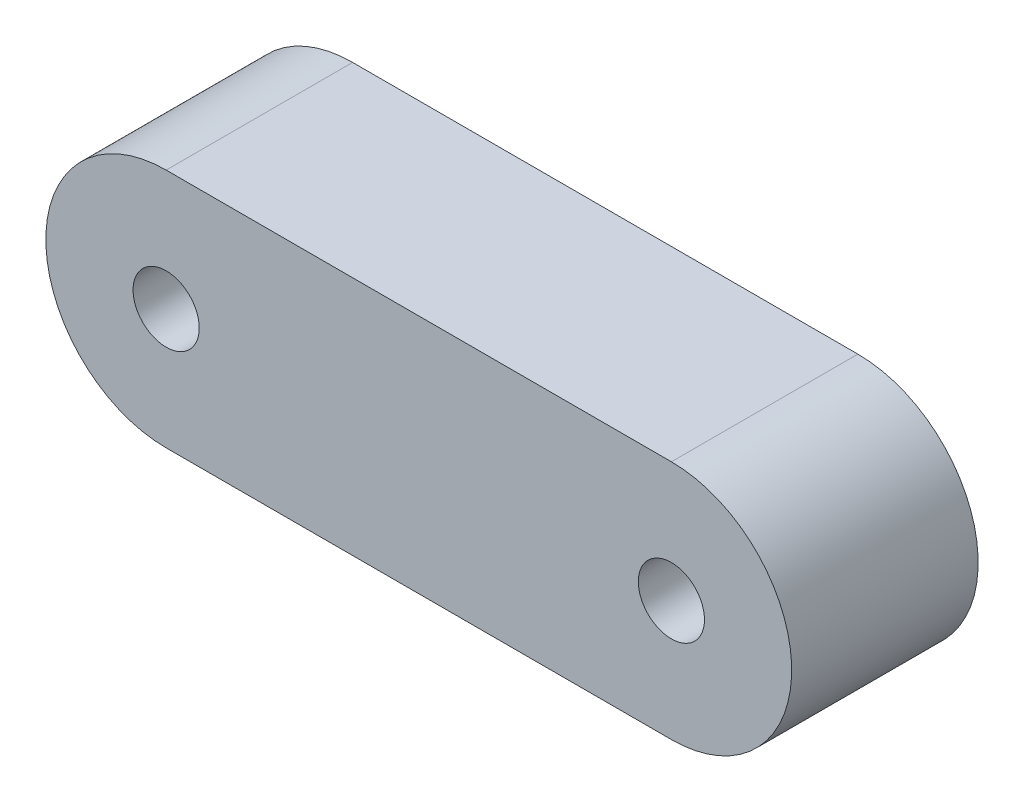
ISO-10303-21;
HEADER;
FILE_DESCRIPTION(('STEP AP214'),'2;1');
FILE_NAME('part.step','',(''),(''),'','','');
FILE_SCHEMA(('AUTOMOTIVE_DESIGN { 1 0 10303 214 1 1 1 1 }'));
ENDSEC;
DATA;
#1=APPLICATION_CONTEXT('core data for automotive mechanical design processes');
#2=APPLICATION_PROTOCOL_DEFINITION('international standard','automotive_design',2000,#1);
#3=PRODUCT_CONTEXT('',#1,'mechanical');
#4=PRODUCT('Part','Part','',(#3));
#5=PRODUCT_RELATED_PRODUCT_CATEGORY('part','',(#4));
#6=PRODUCT_DEFINITION_FORMATION('','',#4);
#7=PRODUCT_DEFINITION_CONTEXT('part definition',#1,'design');
#8=PRODUCT_DEFINITION('design','',#6,#7);
#9=PRODUCT_DEFINITION_SHAPE('','',#8);
#10=(LENGTH_UNIT() NAMED_UNIT(*) SI_UNIT(.MILLI.,.METRE.));
#11=(NAMED_UNIT(*) PLANE_ANGLE_UNIT() SI_UNIT($,.RADIAN.));
#12=(NAMED_UNIT(*) SI_UNIT($,.STERADIAN.) SOLID_ANGLE_UNIT());
#13=UNCERTAINTY_MEASURE_WITH_UNIT(LENGTH_MEASURE(1.E-05),#10,'distance_accuracy_value','');
#14=(GEOMETRIC_REPRESENTATION_CONTEXT(3) GLOBAL_UNCERTAINTY_ASSIGNED_CONTEXT((#13)) GLOBAL_UNIT_ASSIGNED_CONTEXT((#10,
#11,#12)) REPRESENTATION_CONTEXT('',''));
#15=CARTESIAN_POINT('',(0.,0.,0.));
#16=DIRECTION('',(0.,0.,1.));
#17=DIRECTION('',(1.,0.,0.));
#18=AXIS2_PLACEMENT_3D('',#15,#16,#17);
#19=CARTESIAN_POINT('',(0.,0.,15.5));
#20=DIRECTION('',(0.,0.,1.));
#21=DIRECTION('',(1.,0.,0.));
#22=AXIS2_PLACEMENT_3D('',#19,#20,#21);
#23=PLANE('',#22);
#24=CARTESIAN_POINT('',(-42.,0.,15.5));
#25=DIRECTION('',(0.,0.,1.));
#26=DIRECTION('',(1.,0.,0.));
#27=AXIS2_PLACEMENT_3D('',#24,#25,#26);
#28=CIRCLE('',#27,2.74999999999994);
#29=CARTESIAN_POINT('',(-39.2500000000001,0.,15.5));
#30=VERTEX_POINT('',#29);
#31=EDGE_CURVE('E100',#30,#30,#28,.T.);
#32=ORIENTED_EDGE('',*,*,#31,.F.);
#33=EDGE_LOOP('',(#32));
#34=FACE_BOUND('',#33,.T.);
#35=CARTESIAN_POINT('',(0.,0.,15.5));
#36=DIRECTION('',(0.,0.,1.));
#37=DIRECTION('',(1.,0.,0.));
#38=AXIS2_PLACEMENT_3D('',#35,#36,#37);
#39=CIRCLE('',#38,10.);
#40=CARTESIAN_POINT('',(0.,-10.,15.5));
#41=VERTEX_POINT('',#40);
#42=CARTESIAN_POINT('',(0.,10.,15.5));
#43=VERTEX_POINT('',#42);
#44=EDGE_CURVE('E85',#41,#43,#39,.T.);
#45=ORIENTED_EDGE('',*,*,#44,.T.);
#46=DIRECTION('',(-1.,0.,0.));
#47=VECTOR('',#46,1.);
#48=CARTESIAN_POINT('',(0.,10.,15.5));
#49=LINE('',#48,#47);
#50=CARTESIAN_POINT('',(-42.,10.,15.5));
#51=VERTEX_POINT('',#50);
#52=EDGE_CURVE('E80',#43,#51,#49,.T.);
#53=ORIENTED_EDGE('',*,*,#52,.T.);
#54=CARTESIAN_POINT('',(-42.,0.,15.5));
#55=DIRECTION('',(0.,0.,1.));
#56=DIRECTION('',(1.,0.,0.));
#57=AXIS2_PLACEMENT_3D('',#54,#55,#56);
#58=CIRCLE('',#57,10.);
#59=CARTESIAN_POINT('',(-42.,-10.,15.5));
#60=VERTEX_POINT('',#59);
#61=EDGE_CURVE('E83',#51,#60,#58,.T.);
#62=ORIENTED_EDGE('',*,*,#61,.T.);
#63=DIRECTION('',(1.,0.,0.));
#64=VECTOR('',#63,1.);
#65=CARTESIAN_POINT('',(0.,-10.,15.5));
#66=LINE('',#65,#64);
#67=EDGE_CURVE('E50',#60,#41,#66,.T.);
#68=ORIENTED_EDGE('',*,*,#67,.T.);
#69=EDGE_LOOP('',(#45,#53,#62,#68));
#70=FACE_BOUND('',#69,.T.);
#71=CARTESIAN_POINT('',(0.,0.,15.5));
#72=DIRECTION('',(0.,0.,1.));
#73=DIRECTION('',(1.,0.,0.));
#74=AXIS2_PLACEMENT_3D('',#71,#72,#73);
#75=CIRCLE('',#74,2.75);
#76=CARTESIAN_POINT('',(2.75,0.,15.5));
#77=VERTEX_POINT('',#76);
#78=EDGE_CURVE('E115',#77,#77,#75,.T.);
#79=ORIENTED_EDGE('',*,*,#78,.F.);
#80=EDGE_LOOP('',(#79));
#81=FACE_BOUND('',#80,.T.);
#82=ADVANCED_FACE('F33',(#34,#70,#81),#23,.T.);
#83=CARTESIAN_POINT('',(0.,0.,0.));
#84=DIRECTION('',(0.,0.,1.));
#85=DIRECTION('',(1.,0.,0.));
#86=AXIS2_PLACEMENT_3D('',#83,#84,#85);
#87=PLANE('',#86);
#88=CARTESIAN_POINT('',(0.,0.,0.));
#89=DIRECTION('',(0.,0.,1.));
#90=DIRECTION('',(1.,0.,0.));
#91=AXIS2_PLACEMENT_3D('',#88,#89,#90);
#92=CIRCLE('',#91,10.);
#93=CARTESIAN_POINT('',(0.,-10.,0.));
#94=VERTEX_POINT('',#93);
#95=CARTESIAN_POINT('',(0.,10.,0.));
#96=VERTEX_POINT('',#95);
#97=EDGE_CURVE('E97',#94,#96,#92,.T.);
#98=ORIENTED_EDGE('',*,*,#97,.F.);
#99=DIRECTION('',(1.,0.,0.));
#100=VECTOR('',#99,1.);
#101=CARTESIAN_POINT('',(0.,-10.,0.));
#102=LINE('',#101,#100);
#103=CARTESIAN_POINT('',(-42.,-10.,0.));
#104=VERTEX_POINT('',#103);
#105=EDGE_CURVE('E73',#104,#94,#102,.T.);
#106=ORIENTED_EDGE('',*,*,#105,.F.);
#107=CARTESIAN_POINT('',(-42.,0.,0.));
#108=DIRECTION('',(0.,0.,1.));
#109=DIRECTION('',(1.,0.,0.));
#110=AXIS2_PLACEMENT_3D('',#107,#108,#109);
#111=CIRCLE('',#110,10.);
#112=CARTESIAN_POINT('',(-42.,10.,0.));
#113=VERTEX_POINT('',#112);
#114=EDGE_CURVE('E67',#113,#104,#111,.T.);
#115=ORIENTED_EDGE('',*,*,#114,.F.);
#116=DIRECTION('',(-1.,0.,0.));
#117=VECTOR('',#116,1.);
#118=CARTESIAN_POINT('',(0.,10.,0.));
#119=LINE('',#118,#117);
#120=EDGE_CURVE('E89',#96,#113,#119,.T.);
#121=ORIENTED_EDGE('',*,*,#120,.F.);
#122=EDGE_LOOP('',(#98,#106,#115,#121));
#123=FACE_BOUND('',#122,.T.);
#124=CARTESIAN_POINT('',(-42.,0.,0.));
#125=DIRECTION('',(0.,0.,1.));
#126=DIRECTION('',(1.,0.,0.));
#127=AXIS2_PLACEMENT_3D('',#124,#125,#126);
#128=CIRCLE('',#127,2.74999999999994);
#129=CARTESIAN_POINT('',(-39.2500000000001,0.,0.));
#130=VERTEX_POINT('',#129);
#131=EDGE_CURVE('E112',#130,#130,#128,.T.);
#132=ORIENTED_EDGE('',*,*,#131,.T.);
#133=EDGE_LOOP('',(#132));
#134=FACE_BOUND('',#133,.T.);
#135=CARTESIAN_POINT('',(0.,0.,0.));
#136=DIRECTION('',(0.,0.,1.));
#137=DIRECTION('',(1.,0.,0.));
#138=AXIS2_PLACEMENT_3D('',#135,#136,#137);
#139=CIRCLE('',#138,2.75);
#140=CARTESIAN_POINT('',(2.75,0.,0.));
#141=VERTEX_POINT('',#140);
#142=EDGE_CURVE('E118',#141,#141,#139,.T.);
#143=ORIENTED_EDGE('',*,*,#142,.T.);
#144=EDGE_LOOP('',(#143));
#145=FACE_BOUND('',#144,.T.);
#146=ADVANCED_FACE('F108',(#123,#134,#145),#87,.F.);
#147=CARTESIAN_POINT('',(0.,0.,15.5));
#148=DIRECTION('',(0.,0.,-1.));
#149=DIRECTION('',(-1.,0.,0.));
#150=AXIS2_PLACEMENT_3D('',#147,#148,#149);
#151=CYLINDRICAL_SURFACE('',#150,10.);
#152=ORIENTED_EDGE('',*,*,#97,.T.);
#153=DIRECTION('',(0.,0.,-1.));
#154=VECTOR('',#153,1.);
#155=CARTESIAN_POINT('',(0.,10.,15.5));
#156=LINE('',#155,#154);
#157=EDGE_CURVE('E11',#43,#96,#156,.T.);
#158=ORIENTED_EDGE('',*,*,#157,.F.);
#159=ORIENTED_EDGE('',*,*,#44,.F.);
#160=DIRECTION('',(0.,0.,-1.));
#161=VECTOR('',#160,1.);
#162=CARTESIAN_POINT('',(0.,-10.,15.5));
#163=LINE('',#162,#161);
#164=EDGE_CURVE('E93',#41,#94,#163,.T.);
#165=ORIENTED_EDGE('',*,*,#164,.T.);
#166=EDGE_LOOP('',(#152,#158,#159,#165));
#167=FACE_BOUND('',#166,.T.);
#168=ADVANCED_FACE('F35',(#167),#151,.T.);
#169=CARTESIAN_POINT('',(0.,10.,15.5));
#170=DIRECTION('',(0.,-1.,0.));
#171=DIRECTION('',(0.,0.,-1.));
#172=AXIS2_PLACEMENT_3D('',#169,#170,#171);
#173=PLANE('',#172);
#174=ORIENTED_EDGE('',*,*,#120,.T.);
#175=DIRECTION('',(0.,0.,-1.));
#176=VECTOR('',#175,1.);
#177=CARTESIAN_POINT('',(-42.,10.,15.5));
#178=LINE('',#177,#176);
#179=EDGE_CURVE('E42',#51,#113,#178,.T.);
#180=ORIENTED_EDGE('',*,*,#179,.F.);
#181=ORIENTED_EDGE('',*,*,#52,.F.);
#182=ORIENTED_EDGE('',*,*,#157,.T.);
#183=EDGE_LOOP('',(#174,#180,#181,#182));
#184=FACE_BOUND('',#183,.T.);
#185=ADVANCED_FACE('F88',(#184),#173,.F.);
#186=CARTESIAN_POINT('',(-42.,0.,15.5));
#187=DIRECTION('',(0.,0.,-1.));
#188=DIRECTION('',(-1.,0.,0.));
#189=AXIS2_PLACEMENT_3D('',#186,#187,#188);
#190=CYLINDRICAL_SURFACE('',#189,10.);
#191=ORIENTED_EDGE('',*,*,#114,.T.);
#192=DIRECTION('',(0.,0.,-1.));
#193=VECTOR('',#192,1.);
#194=CARTESIAN_POINT('',(-42.,-10.,15.5));
#195=LINE('',#194,#193);
#196=EDGE_CURVE('E90',#60,#104,#195,.T.);
#197=ORIENTED_EDGE('',*,*,#196,.F.);
#198=ORIENTED_EDGE('',*,*,#61,.F.);
#199=ORIENTED_EDGE('',*,*,#179,.T.);
#200=EDGE_LOOP('',(#191,#197,#198,#199));
#201=FACE_BOUND('',#200,.T.);
#202=ADVANCED_FACE('F91',(#201),#190,.T.);
#203=CARTESIAN_POINT('',(0.,-10.,15.5));
#204=DIRECTION('',(0.,1.,0.));
#205=DIRECTION('',(0.,0.,1.));
#206=AXIS2_PLACEMENT_3D('',#203,#204,#205);
#207=PLANE('',#206);
#208=ORIENTED_EDGE('',*,*,#105,.T.);
#209=ORIENTED_EDGE('',*,*,#164,.F.);
#210=ORIENTED_EDGE('',*,*,#67,.F.);
#211=ORIENTED_EDGE('',*,*,#196,.T.);
#212=EDGE_LOOP('',(#208,#209,#210,#211));
#213=FACE_BOUND('',#212,.T.);
#214=ADVANCED_FACE('F105',(#213),#207,.F.);
#215=CARTESIAN_POINT('',(-42.,0.,15.5));
#216=DIRECTION('',(0.,0.,-1.));
#217=DIRECTION('',(-1.,0.,0.));
#218=AXIS2_PLACEMENT_3D('',#215,#216,#217);
#219=CYLINDRICAL_SURFACE('',#218,2.74999999999994);
#220=ORIENTED_EDGE('',*,*,#31,.T.);
#221=EDGE_LOOP('',(#220));
#222=FACE_BOUND('',#221,.T.);
#223=ORIENTED_EDGE('',*,*,#131,.F.);
#224=EDGE_LOOP('',(#223));
#225=FACE_BOUND('',#224,.T.);
#226=ADVANCED_FACE('F135',(#222,#225),#219,.F.);
#227=CARTESIAN_POINT('',(0.,0.,15.5));
#228=DIRECTION('',(0.,0.,-1.));
#229=DIRECTION('',(-1.,0.,0.));
#230=AXIS2_PLACEMENT_3D('',#227,#228,#229);
#231=CYLINDRICAL_SURFACE('',#230,2.75);
#232=ORIENTED_EDGE('',*,*,#78,.T.);
#233=EDGE_LOOP('',(#232));
#234=FACE_BOUND('',#233,.T.);
#235=ORIENTED_EDGE('',*,*,#142,.F.);
#236=EDGE_LOOP('',(#235));
#237=FACE_BOUND('',#236,.T.);
#238=ADVANCED_FACE('F124',(#234,#237),#231,.F.);
#239=CLOSED_SHELL('',(#82,#146,#168,#185,#202,#214,#226,#238));
#240=MANIFOLD_SOLID_BREP('B2',#239);
#241=ADVANCED_BREP_SHAPE_REPRESENTATION('',(#18,#240),#14);
#242=SHAPE_DEFINITION_REPRESENTATION(#9,#241);
ENDSEC;
END-ISO-10303-21;
